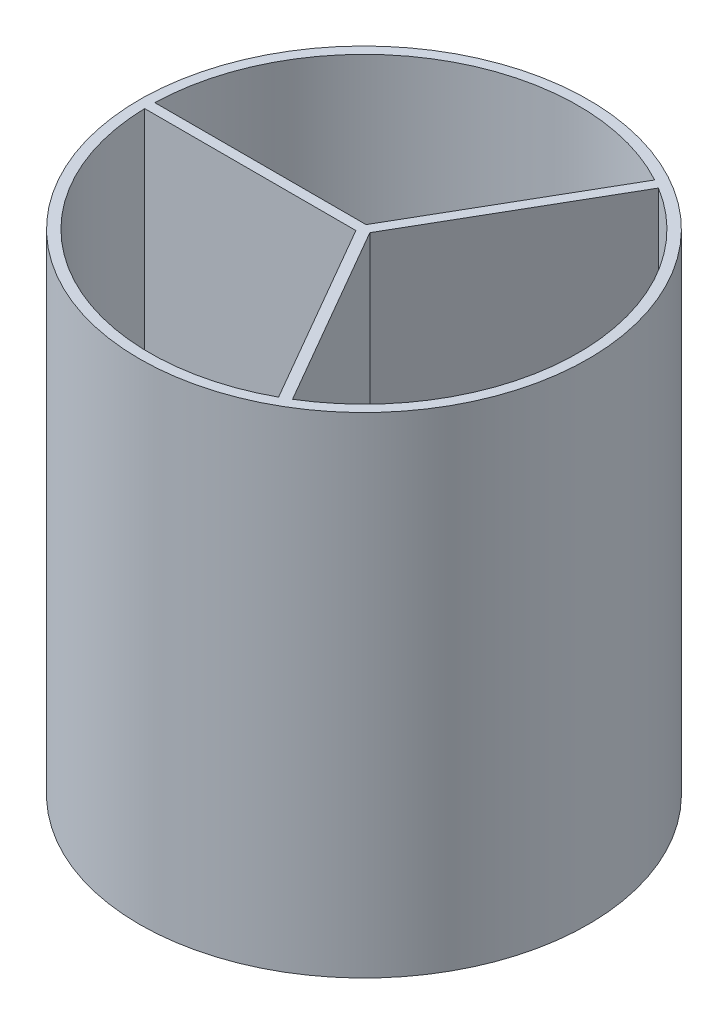
ISO-10303-21;
HEADER;
FILE_DESCRIPTION(('STEP AP214'),'2;1');
FILE_NAME('part.step','',(''),(''),'','','');
FILE_SCHEMA(('AUTOMOTIVE_DESIGN { 1 0 10303 214 1 1 1 1 }'));
ENDSEC;
DATA;
#1=APPLICATION_CONTEXT('core data for automotive mechanical design processes');
#2=APPLICATION_PROTOCOL_DEFINITION('international standard','automotive_design',2000,#1);
#3=PRODUCT_CONTEXT('',#1,'mechanical');
#4=PRODUCT('Part','Part','',(#3));
#5=PRODUCT_RELATED_PRODUCT_CATEGORY('part','',(#4));
#6=PRODUCT_DEFINITION_FORMATION('','',#4);
#7=PRODUCT_DEFINITION_CONTEXT('part definition',#1,'design');
#8=PRODUCT_DEFINITION('design','',#6,#7);
#9=PRODUCT_DEFINITION_SHAPE('','',#8);
#10=(LENGTH_UNIT() NAMED_UNIT(*) SI_UNIT(.MILLI.,.METRE.));
#11=(NAMED_UNIT(*) PLANE_ANGLE_UNIT() SI_UNIT($,.RADIAN.));
#12=(NAMED_UNIT(*) SI_UNIT($,.STERADIAN.) SOLID_ANGLE_UNIT());
#13=UNCERTAINTY_MEASURE_WITH_UNIT(LENGTH_MEASURE(1.E-05),#10,'distance_accuracy_value','');
#14=(GEOMETRIC_REPRESENTATION_CONTEXT(3) GLOBAL_UNCERTAINTY_ASSIGNED_CONTEXT((#13)) GLOBAL_UNIT_ASSIGNED_CONTEXT((#10,
#11,#12)) REPRESENTATION_CONTEXT('',''));
#15=CARTESIAN_POINT('',(0.,0.,0.));
#16=DIRECTION('',(0.,0.,1.));
#17=DIRECTION('',(1.,0.,0.));
#18=AXIS2_PLACEMENT_3D('',#15,#16,#17);
#19=CARTESIAN_POINT('',(0.,609.6,0.));
#20=DIRECTION('',(0.,1.,0.));
#21=DIRECTION('',(0.,0.,1.));
#22=AXIS2_PLACEMENT_3D('',#19,#20,#21);
#23=PLANE('',#22);
#24=CARTESIAN_POINT('',(0.,609.6,0.));
#25=DIRECTION('',(0.,1.,0.));
#26=DIRECTION('',(0.,0.,1.));
#27=AXIS2_PLACEMENT_3D('',#24,#25,#26);
#28=CIRCLE('',#27,279.4);
#29=CARTESIAN_POINT('',(0.,609.6,279.4));
#30=VERTEX_POINT('',#29);
#31=EDGE_CURVE('E88',#30,#30,#28,.T.);
#32=ORIENTED_EDGE('',*,*,#31,.T.);
#33=EDGE_LOOP('',(#32));
#34=FACE_BOUND('',#33,.T.);
#35=CARTESIAN_POINT('',(0.,609.6,0.));
#36=DIRECTION('',(0.,1.,0.));
#37=DIRECTION('',(0.,0.,1.));
#38=AXIS2_PLACEMENT_3D('',#35,#36,#37);
#39=CIRCLE('',#38,266.7);
#40=CARTESIAN_POINT('',(127.809487071956,609.6,-234.080381523962));
#41=VERTEX_POINT('',#40);
#42=CARTESIAN_POINT('',(-266.624487569325,609.6,-6.3460718869922));
#43=VERTEX_POINT('',#42);
#44=EDGE_CURVE('E238',#41,#43,#39,.T.);
#45=ORIENTED_EDGE('',*,*,#44,.F.);
#46=DIRECTION('',(-0.5,0.,0.866025403784439));
#47=VECTOR('',#46,1.);
#48=CARTESIAN_POINT('',(-5.50266315968471,609.6,-3.1769640565038));
#49=LINE('',#48,#47);
#50=CARTESIAN_POINT('',(-3.67297790066129,609.6,-6.3460718869922));
#51=VERTEX_POINT('',#50);
#52=EDGE_CURVE('E216',#41,#51,#49,.T.);
#53=ORIENTED_EDGE('',*,*,#52,.T.);
#54=DIRECTION('',(1.,0.,0.));
#55=VECTOR('',#54,1.);
#56=CARTESIAN_POINT('',(0.,609.6,-6.3460718869922));
#57=LINE('',#56,#55);
#58=EDGE_CURVE('E226',#43,#51,#57,.T.);
#59=ORIENTED_EDGE('',*,*,#58,.F.);
#60=EDGE_LOOP('',(#45,#53,#59));
#61=FACE_BOUND('',#60,.T.);
#62=CARTESIAN_POINT('',(0.,609.6,0.));
#63=DIRECTION('',(0.,1.,0.));
#64=DIRECTION('',(0.,0.,1.));
#65=AXIS2_PLACEMENT_3D('',#62,#63,#64);
#66=CIRCLE('',#65,266.7);
#67=CARTESIAN_POINT('',(138.814813391326,609.6,227.726453410954));
#68=VERTEX_POINT('',#67);
#69=CARTESIAN_POINT('',(138.80810325304,609.6,-227.730543562548));
#70=VERTEX_POINT('',#69);
#71=EDGE_CURVE('E179',#68,#70,#66,.T.);
#72=ORIENTED_EDGE('',*,*,#71,.F.);
#73=DIRECTION('',(-0.5,0.,-0.866025403784438));
#74=VECTOR('',#73,1.);
#75=CARTESIAN_POINT('',(5.50266315968496,609.6,-3.17696405650395));
#76=LINE('',#75,#74);
#77=CARTESIAN_POINT('',(7.33234841870841,609.6,-0.0078562260155293));
#78=VERTEX_POINT('',#77);
#79=EDGE_CURVE('E103',#68,#78,#76,.T.);
#80=ORIENTED_EDGE('',*,*,#79,.T.);
#81=DIRECTION('',(-0.5,0.,0.866025403784439));
#82=VECTOR('',#81,1.);
#83=CARTESIAN_POINT('',(5.49585946837765,609.6,3.17303594349619));
#84=LINE('',#83,#82);
#85=EDGE_CURVE('E168',#70,#78,#84,.T.);
#86=ORIENTED_EDGE('',*,*,#85,.F.);
#87=EDGE_LOOP('',(#72,#80,#86));
#88=FACE_BOUND('',#87,.T.);
#89=CARTESIAN_POINT('',(0.,609.6,0.));
#90=DIRECTION('',(0.,1.,0.));
#91=DIRECTION('',(0.,0.,1.));
#92=AXIS2_PLACEMENT_3D('',#89,#90,#91);
#93=CIRCLE('',#92,266.7);
#94=CARTESIAN_POINT('',(-266.624300463282,609.6,6.3539281130078));
#95=VERTEX_POINT('',#94);
#96=CARTESIAN_POINT('',(127.816384316285,609.6,234.07661544954));
#97=VERTEX_POINT('',#96);
#98=EDGE_CURVE('E206',#95,#97,#93,.T.);
#99=ORIENTED_EDGE('',*,*,#98,.F.);
#100=DIRECTION('',(1.,0.,0.));
#101=VECTOR('',#100,1.);
#102=CARTESIAN_POINT('',(0.,609.6,6.3539281130078));
#103=LINE('',#102,#101);
#104=CARTESIAN_POINT('',(-3.65937051804663,609.6,6.3539281130078));
#105=VERTEX_POINT('',#104);
#106=EDGE_CURVE('E95',#95,#105,#103,.T.);
#107=ORIENTED_EDGE('',*,*,#106,.T.);
#108=DIRECTION('',(-0.5,0.,-0.866025403784438));
#109=VECTOR('',#108,1.);
#110=CARTESIAN_POINT('',(-5.49585946837741,609.6,3.17303594349605));
#111=LINE('',#110,#109);
#112=EDGE_CURVE('E195',#97,#105,#111,.T.);
#113=ORIENTED_EDGE('',*,*,#112,.F.);
#114=EDGE_LOOP('',(#99,#107,#113));
#115=FACE_BOUND('',#114,.T.);
#116=ADVANCED_FACE('F79',(#34,#61,#88,#115),#23,.T.);
#117=CARTESIAN_POINT('',(0.,609.6,0.));
#118=DIRECTION('',(0.,-1.,0.));
#119=DIRECTION('',(0.,0.,-1.));
#120=AXIS2_PLACEMENT_3D('',#117,#118,#119);
#121=CYLINDRICAL_SURFACE('',#120,279.4);
#122=ORIENTED_EDGE('',*,*,#31,.F.);
#123=EDGE_LOOP('',(#122));
#124=FACE_BOUND('',#123,.T.);
#125=CARTESIAN_POINT('',(0.,0.,0.));
#126=DIRECTION('',(0.,1.,0.));
#127=DIRECTION('',(0.,0.,1.));
#128=AXIS2_PLACEMENT_3D('',#125,#126,#127);
#129=CIRCLE('',#128,279.4);
#130=CARTESIAN_POINT('',(0.,0.,279.4));
#131=VERTEX_POINT('',#130);
#132=EDGE_CURVE('E248',#131,#131,#129,.T.);
#133=ORIENTED_EDGE('',*,*,#132,.T.);
#134=EDGE_LOOP('',(#133));
#135=FACE_BOUND('',#134,.T.);
#136=ADVANCED_FACE('F81',(#124,#135),#121,.T.);
#137=CARTESIAN_POINT('',(0.,0.,0.));
#138=DIRECTION('',(0.,1.,0.));
#139=DIRECTION('',(0.,0.,1.));
#140=AXIS2_PLACEMENT_3D('',#137,#138,#139);
#141=PLANE('',#140);
#142=CARTESIAN_POINT('',(0.,0.,0.));
#143=DIRECTION('',(0.,1.,0.));
#144=DIRECTION('',(0.,0.,1.));
#145=AXIS2_PLACEMENT_3D('',#142,#143,#144);
#146=CIRCLE('',#145,12.7);
#147=CARTESIAN_POINT('',(0.,0.,12.7));
#148=VERTEX_POINT('',#147);
#149=EDGE_CURVE('E12',#148,#148,#146,.F.);
#150=ORIENTED_EDGE('',*,*,#149,.F.);
#151=EDGE_LOOP('',(#150));
#152=FACE_BOUND('',#151,.T.);
#153=ORIENTED_EDGE('',*,*,#132,.F.);
#154=EDGE_LOOP('',(#153));
#155=FACE_BOUND('',#154,.T.);
#156=ADVANCED_FACE('F262',(#152,#155),#141,.F.);
#157=CARTESIAN_POINT('',(-5.50266315968471,12.6999999999999,-3.1769640565038));
#158=DIRECTION('',(-0.866025403784439,0.,-0.5));
#159=DIRECTION('',(-0.5,0.,0.866025403784439));
#160=AXIS2_PLACEMENT_3D('',#157,#158,#159);
#161=PLANE('',#160);
#162=ORIENTED_EDGE('',*,*,#52,.F.);
#163=DIRECTION('',(0.,1.,0.));
#164=VECTOR('',#163,1.);
#165=CARTESIAN_POINT('',(127.809487071956,12.6999999999999,-234.080381523962));
#166=LINE('',#165,#164);
#167=CARTESIAN_POINT('',(127.809487071956,12.6999999999999,-234.080381523962));
#168=VERTEX_POINT('',#167);
#169=EDGE_CURVE('E234',#168,#41,#166,.T.);
#170=ORIENTED_EDGE('',*,*,#169,.F.);
#171=DIRECTION('',(-0.5,0.,0.866025403784439));
#172=VECTOR('',#171,1.);
#173=CARTESIAN_POINT('',(-5.50266315968471,12.6999999999999,-3.1769640565038));
#174=LINE('',#173,#172);
#175=CARTESIAN_POINT('',(-3.67297790066129,12.6999999999999,-6.3460718869922));
#176=VERTEX_POINT('',#175);
#177=EDGE_CURVE('E222',#168,#176,#174,.T.);
#178=ORIENTED_EDGE('',*,*,#177,.T.);
#179=DIRECTION('',(0.,1.,0.));
#180=VECTOR('',#179,1.);
#181=CARTESIAN_POINT('',(-3.67297790066129,12.6999999999999,-6.3460718869922));
#182=LINE('',#181,#180);
#183=EDGE_CURVE('E245',#176,#51,#182,.T.);
#184=ORIENTED_EDGE('',*,*,#183,.T.);
#185=EDGE_LOOP('',(#162,#170,#178,#184));
#186=FACE_BOUND('',#185,.T.);
#187=ADVANCED_FACE('F264',(#186),#161,.T.);
#188=CARTESIAN_POINT('',(0.,12.6999999999999,-6.3460718869922));
#189=DIRECTION('',(0.,0.,1.));
#190=DIRECTION('',(1.,0.,0.));
#191=AXIS2_PLACEMENT_3D('',#188,#189,#190);
#192=PLANE('',#191);
#193=ORIENTED_EDGE('',*,*,#58,.T.);
#194=ORIENTED_EDGE('',*,*,#183,.F.);
#195=DIRECTION('',(1.,0.,0.));
#196=VECTOR('',#195,1.);
#197=CARTESIAN_POINT('',(0.,12.6999999999999,-6.3460718869922));
#198=LINE('',#197,#196);
#199=CARTESIAN_POINT('',(-266.624487569325,12.6999999999999,-6.3460718869922));
#200=VERTEX_POINT('',#199);
#201=EDGE_CURVE('E230',#200,#176,#198,.T.);
#202=ORIENTED_EDGE('',*,*,#201,.F.);
#203=DIRECTION('',(0.,1.,0.));
#204=VECTOR('',#203,1.);
#205=CARTESIAN_POINT('',(-266.624487569325,12.6999999999999,-6.3460718869922));
#206=LINE('',#205,#204);
#207=EDGE_CURVE('E249',#200,#43,#206,.T.);
#208=ORIENTED_EDGE('',*,*,#207,.T.);
#209=EDGE_LOOP('',(#193,#194,#202,#208));
#210=FACE_BOUND('',#209,.T.);
#211=ADVANCED_FACE('F270',(#210),#192,.F.);
#212=CARTESIAN_POINT('',(0.,12.6999999999999,0.));
#213=DIRECTION('',(0.,1.,0.));
#214=DIRECTION('',(0.,0.,1.));
#215=AXIS2_PLACEMENT_3D('',#212,#213,#214);
#216=CYLINDRICAL_SURFACE('',#215,266.7);
#217=ORIENTED_EDGE('',*,*,#44,.T.);
#218=ORIENTED_EDGE('',*,*,#207,.F.);
#219=CARTESIAN_POINT('',(0.,12.6999999999999,0.));
#220=DIRECTION('',(0.,1.,0.));
#221=DIRECTION('',(0.,0.,1.));
#222=AXIS2_PLACEMENT_3D('',#219,#220,#221);
#223=CIRCLE('',#222,266.7);
#224=EDGE_CURVE('E225',#168,#200,#223,.T.);
#225=ORIENTED_EDGE('',*,*,#224,.F.);
#226=ORIENTED_EDGE('',*,*,#169,.T.);
#227=EDGE_LOOP('',(#217,#218,#225,#226));
#228=FACE_BOUND('',#227,.T.);
#229=ADVANCED_FACE('F282',(#228),#216,.F.);
#230=CARTESIAN_POINT('',(0.,12.6999999999999,0.));
#231=DIRECTION('',(0.,1.,0.));
#232=DIRECTION('',(0.,0.,1.));
#233=AXIS2_PLACEMENT_3D('',#230,#231,#232);
#234=PLANE('',#233);
#235=ORIENTED_EDGE('',*,*,#177,.F.);
#236=ORIENTED_EDGE('',*,*,#224,.T.);
#237=ORIENTED_EDGE('',*,*,#201,.T.);
#238=EDGE_LOOP('',(#235,#236,#237));
#239=FACE_BOUND('',#238,.T.);
#240=ADVANCED_FACE('F285',(#239),#234,.T.);
#241=CARTESIAN_POINT('',(5.50266315968496,12.6999999999999,-3.17696405650395));
#242=DIRECTION('',(0.866025403784438,0.,-0.5));
#243=DIRECTION('',(-0.500000000000001,0.,-0.866025403784438));
#244=AXIS2_PLACEMENT_3D('',#241,#242,#243);
#245=PLANE('',#244);
#246=ORIENTED_EDGE('',*,*,#79,.F.);
#247=DIRECTION('',(0.,1.,0.));
#248=VECTOR('',#247,1.);
#249=CARTESIAN_POINT('',(138.814813391326,12.6999999999999,227.726453410954));
#250=LINE('',#249,#248);
#251=CARTESIAN_POINT('',(138.814813391326,12.6999999999999,227.726453410954));
#252=VERTEX_POINT('',#251);
#253=EDGE_CURVE('E148',#252,#68,#250,.T.);
#254=ORIENTED_EDGE('',*,*,#253,.F.);
#255=DIRECTION('',(-0.5,0.,-0.866025403784438));
#256=VECTOR('',#255,1.);
#257=CARTESIAN_POINT('',(5.50266315968496,12.6999999999999,-3.17696405650395));
#258=LINE('',#257,#256);
#259=CARTESIAN_POINT('',(7.33234841870841,12.6999999999999,-0.0078562260155293));
#260=VERTEX_POINT('',#259);
#261=EDGE_CURVE('E151',#252,#260,#258,.T.);
#262=ORIENTED_EDGE('',*,*,#261,.T.);
#263=DIRECTION('',(0.,1.,0.));
#264=VECTOR('',#263,1.);
#265=CARTESIAN_POINT('',(7.33234841870841,12.6999999999999,-0.0078562260155293));
#266=LINE('',#265,#264);
#267=EDGE_CURVE('E186',#260,#78,#266,.T.);
#268=ORIENTED_EDGE('',*,*,#267,.T.);
#269=EDGE_LOOP('',(#246,#254,#262,#268));
#270=FACE_BOUND('',#269,.T.);
#271=ADVANCED_FACE('F150',(#270),#245,.T.);
#272=CARTESIAN_POINT('',(5.49585946837765,12.6999999999999,3.17303594349619));
#273=DIRECTION('',(-0.866025403784439,0.,-0.5));
#274=DIRECTION('',(-0.5,0.,0.866025403784439));
#275=AXIS2_PLACEMENT_3D('',#272,#273,#274);
#276=PLANE('',#275);
#277=ORIENTED_EDGE('',*,*,#85,.T.);
#278=ORIENTED_EDGE('',*,*,#267,.F.);
#279=DIRECTION('',(-0.5,0.,0.866025403784439));
#280=VECTOR('',#279,1.);
#281=CARTESIAN_POINT('',(5.49585946837765,12.6999999999999,3.17303594349619));
#282=LINE('',#281,#280);
#283=CARTESIAN_POINT('',(138.80810325304,12.6999999999999,-227.730543562548));
#284=VERTEX_POINT('',#283);
#285=EDGE_CURVE('E159',#284,#260,#282,.T.);
#286=ORIENTED_EDGE('',*,*,#285,.F.);
#287=DIRECTION('',(0.,1.,0.));
#288=VECTOR('',#287,1.);
#289=CARTESIAN_POINT('',(138.80810325304,12.6999999999999,-227.730543562548));
#290=LINE('',#289,#288);
#291=EDGE_CURVE('E158',#284,#70,#290,.T.);
#292=ORIENTED_EDGE('',*,*,#291,.T.);
#293=EDGE_LOOP('',(#277,#278,#286,#292));
#294=FACE_BOUND('',#293,.T.);
#295=ADVANCED_FACE('F311',(#294),#276,.F.);
#296=CARTESIAN_POINT('',(0.,12.6999999999999,0.));
#297=DIRECTION('',(0.,1.,0.));
#298=DIRECTION('',(0.,0.,1.));
#299=AXIS2_PLACEMENT_3D('',#296,#297,#298);
#300=CYLINDRICAL_SURFACE('',#299,266.7);
#301=ORIENTED_EDGE('',*,*,#71,.T.);
#302=ORIENTED_EDGE('',*,*,#291,.F.);
#303=CARTESIAN_POINT('',(0.,12.6999999999999,0.));
#304=DIRECTION('',(0.,1.,0.));
#305=DIRECTION('',(0.,0.,1.));
#306=AXIS2_PLACEMENT_3D('',#303,#304,#305);
#307=CIRCLE('',#306,266.7);
#308=EDGE_CURVE('E165',#252,#284,#307,.T.);
#309=ORIENTED_EDGE('',*,*,#308,.F.);
#310=ORIENTED_EDGE('',*,*,#253,.T.);
#311=EDGE_LOOP('',(#301,#302,#309,#310));
#312=FACE_BOUND('',#311,.T.);
#313=ADVANCED_FACE('F170',(#312),#300,.F.);
#314=CARTESIAN_POINT('',(0.,12.6999999999999,0.));
#315=DIRECTION('',(0.,1.,0.));
#316=DIRECTION('',(0.,0.,1.));
#317=AXIS2_PLACEMENT_3D('',#314,#315,#316);
#318=PLANE('',#317);
#319=ORIENTED_EDGE('',*,*,#261,.F.);
#320=ORIENTED_EDGE('',*,*,#308,.T.);
#321=ORIENTED_EDGE('',*,*,#285,.T.);
#322=EDGE_LOOP('',(#319,#320,#321));
#323=FACE_BOUND('',#322,.T.);
#324=ADVANCED_FACE('F164',(#323),#318,.T.);
#325=CARTESIAN_POINT('',(0.,12.6999999999999,6.3539281130078));
#326=DIRECTION('',(0.,0.,1.));
#327=DIRECTION('',(1.,0.,0.));
#328=AXIS2_PLACEMENT_3D('',#325,#326,#327);
#329=PLANE('',#328);
#330=ORIENTED_EDGE('',*,*,#106,.F.);
#331=DIRECTION('',(0.,1.,0.));
#332=VECTOR('',#331,1.);
#333=CARTESIAN_POINT('',(-266.624300463283,12.6999999999999,6.3539281130078));
#334=LINE('',#333,#332);
#335=CARTESIAN_POINT('',(-266.624300463283,12.6999999999999,6.3539281130078));
#336=VERTEX_POINT('',#335);
#337=EDGE_CURVE('E203',#336,#95,#334,.T.);
#338=ORIENTED_EDGE('',*,*,#337,.F.);
#339=DIRECTION('',(1.,0.,0.));
#340=VECTOR('',#339,1.);
#341=CARTESIAN_POINT('',(0.,12.6999999999999,6.3539281130078));
#342=LINE('',#341,#340);
#343=CARTESIAN_POINT('',(-3.65937051804663,12.6999999999999,6.3539281130078));
#344=VERTEX_POINT('',#343);
#345=EDGE_CURVE('E191',#336,#344,#342,.T.);
#346=ORIENTED_EDGE('',*,*,#345,.T.);
#347=DIRECTION('',(0.,1.,0.));
#348=VECTOR('',#347,1.);
#349=CARTESIAN_POINT('',(-3.65937051804663,12.6999999999999,6.3539281130078));
#350=LINE('',#349,#348);
#351=EDGE_CURVE('E213',#344,#105,#350,.T.);
#352=ORIENTED_EDGE('',*,*,#351,.T.);
#353=EDGE_LOOP('',(#330,#338,#346,#352));
#354=FACE_BOUND('',#353,.T.);
#355=ADVANCED_FACE('F293',(#354),#329,.T.);
#356=CARTESIAN_POINT('',(-5.49585946837741,12.6999999999999,3.17303594349605));
#357=DIRECTION('',(0.866025403784438,0.,-0.5));
#358=DIRECTION('',(-0.500000000000001,0.,-0.866025403784438));
#359=AXIS2_PLACEMENT_3D('',#356,#357,#358);
#360=PLANE('',#359);
#361=ORIENTED_EDGE('',*,*,#112,.T.);
#362=ORIENTED_EDGE('',*,*,#351,.F.);
#363=DIRECTION('',(-0.5,0.,-0.866025403784438));
#364=VECTOR('',#363,1.);
#365=CARTESIAN_POINT('',(-5.49585946837741,12.6999999999999,3.17303594349605));
#366=LINE('',#365,#364);
#367=CARTESIAN_POINT('',(127.816384316285,12.6999999999999,234.07661544954));
#368=VERTEX_POINT('',#367);
#369=EDGE_CURVE('E199',#368,#344,#366,.T.);
#370=ORIENTED_EDGE('',*,*,#369,.F.);
#371=DIRECTION('',(0.,1.,0.));
#372=VECTOR('',#371,1.);
#373=CARTESIAN_POINT('',(127.816384316285,12.6999999999999,234.07661544954));
#374=LINE('',#373,#372);
#375=EDGE_CURVE('E217',#368,#97,#374,.T.);
#376=ORIENTED_EDGE('',*,*,#375,.T.);
#377=EDGE_LOOP('',(#361,#362,#370,#376));
#378=FACE_BOUND('',#377,.T.);
#379=ADVANCED_FACE('F296',(#378),#360,.F.);
#380=CARTESIAN_POINT('',(0.,12.6999999999999,0.));
#381=DIRECTION('',(0.,1.,0.));
#382=DIRECTION('',(0.,0.,1.));
#383=AXIS2_PLACEMENT_3D('',#380,#381,#382);
#384=CYLINDRICAL_SURFACE('',#383,266.7);
#385=ORIENTED_EDGE('',*,*,#98,.T.);
#386=ORIENTED_EDGE('',*,*,#375,.F.);
#387=CARTESIAN_POINT('',(0.,12.6999999999999,0.));
#388=DIRECTION('',(0.,1.,0.));
#389=DIRECTION('',(0.,0.,1.));
#390=AXIS2_PLACEMENT_3D('',#387,#388,#389);
#391=CIRCLE('',#390,266.7);
#392=EDGE_CURVE('E194',#336,#368,#391,.T.);
#393=ORIENTED_EDGE('',*,*,#392,.F.);
#394=ORIENTED_EDGE('',*,*,#337,.T.);
#395=EDGE_LOOP('',(#385,#386,#393,#394));
#396=FACE_BOUND('',#395,.T.);
#397=ADVANCED_FACE('F297',(#396),#384,.F.);
#398=CARTESIAN_POINT('',(0.,12.6999999999999,0.));
#399=DIRECTION('',(0.,1.,0.));
#400=DIRECTION('',(0.,0.,1.));
#401=AXIS2_PLACEMENT_3D('',#398,#399,#400);
#402=PLANE('',#401);
#403=ORIENTED_EDGE('',*,*,#345,.F.);
#404=ORIENTED_EDGE('',*,*,#392,.T.);
#405=ORIENTED_EDGE('',*,*,#369,.T.);
#406=EDGE_LOOP('',(#403,#404,#405));
#407=FACE_BOUND('',#406,.T.);
#408=ADVANCED_FACE('F300',(#407),#402,.T.);
#409=CARTESIAN_POINT('',(0.,-25.4,0.));
#410=DIRECTION('',(0.,1.,0.));
#411=DIRECTION('',(0.,0.,1.));
#412=AXIS2_PLACEMENT_3D('',#409,#410,#411);
#413=CYLINDRICAL_SURFACE('',#412,12.7);
#414=CARTESIAN_POINT('',(0.,-25.4,0.));
#415=DIRECTION('',(0.,-1.,0.));
#416=DIRECTION('',(0.,0.,-1.));
#417=AXIS2_PLACEMENT_3D('',#414,#415,#416);
#418=CIRCLE('',#417,12.7);
#419=CARTESIAN_POINT('',(0.,-25.4,-12.7));
#420=VERTEX_POINT('',#419);
#421=EDGE_CURVE('E180',#420,#420,#418,.T.);
#422=ORIENTED_EDGE('',*,*,#421,.F.);
#423=EDGE_LOOP('',(#422));
#424=FACE_BOUND('',#423,.T.);
#425=ORIENTED_EDGE('',*,*,#149,.T.);
#426=EDGE_LOOP('',(#425));
#427=FACE_BOUND('',#426,.T.);
#428=ADVANCED_FACE('F307',(#424,#427),#413,.T.);
#429=CARTESIAN_POINT('',(0.,-25.4,0.));
#430=DIRECTION('',(0.,-1.,0.));
#431=DIRECTION('',(0.,0.,-1.));
#432=AXIS2_PLACEMENT_3D('',#429,#430,#431);
#433=PLANE('',#432);
#434=ORIENTED_EDGE('',*,*,#421,.T.);
#435=EDGE_LOOP('',(#434));
#436=FACE_BOUND('',#435,.T.);
#437=ADVANCED_FACE('F321',(#436),#433,.T.);
#438=CLOSED_SHELL('',(#116,#136,#156,#187,#211,#229,#240,#271,#295,#313,#324,#355,#379,#397,
#408,#428,#437));
#439=MANIFOLD_SOLID_BREP('B2',#438);
#440=ADVANCED_BREP_SHAPE_REPRESENTATION('',(#18,#439),#14);
#441=SHAPE_DEFINITION_REPRESENTATION(#9,#440);
ENDSEC;
END-ISO-10303-21;
